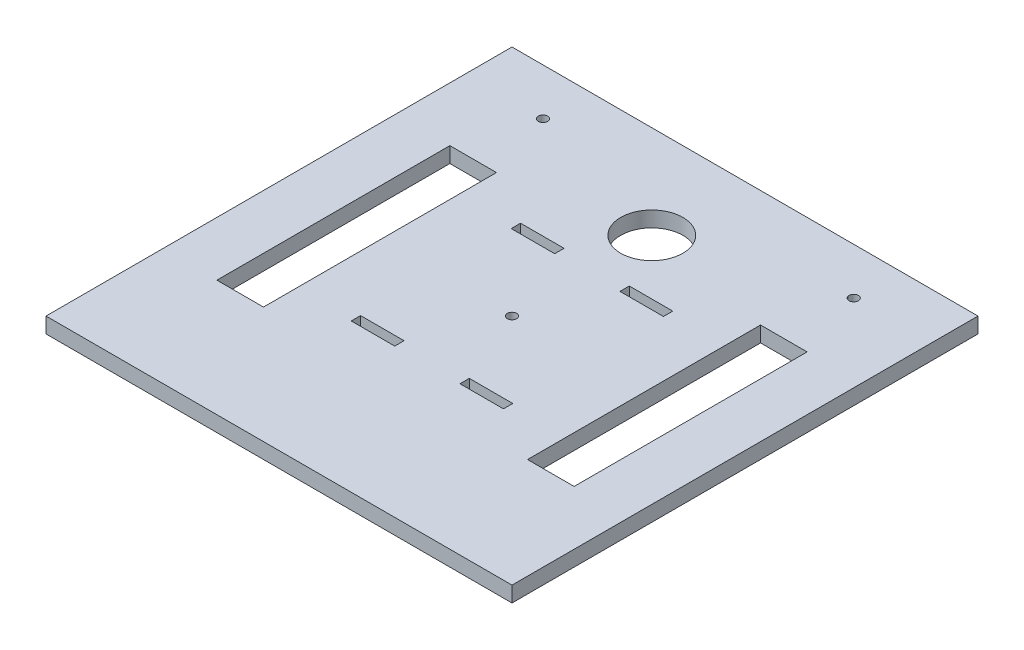
ISO-10303-21;
HEADER;
FILE_DESCRIPTION(('STEP AP214'),'2;1');
FILE_NAME('part.step','',(''),(''),'','','');
FILE_SCHEMA(('AUTOMOTIVE_DESIGN { 1 0 10303 214 1 1 1 1 }'));
ENDSEC;
DATA;
#1=APPLICATION_CONTEXT('core data for automotive mechanical design processes');
#2=APPLICATION_PROTOCOL_DEFINITION('international standard','automotive_design',2000,#1);
#3=PRODUCT_CONTEXT('',#1,'mechanical');
#4=PRODUCT('Part','Part','',(#3));
#5=PRODUCT_RELATED_PRODUCT_CATEGORY('part','',(#4));
#6=PRODUCT_DEFINITION_FORMATION('','',#4);
#7=PRODUCT_DEFINITION_CONTEXT('part definition',#1,'design');
#8=PRODUCT_DEFINITION('design','',#6,#7);
#9=PRODUCT_DEFINITION_SHAPE('','',#8);
#10=(LENGTH_UNIT() NAMED_UNIT(*) SI_UNIT(.MILLI.,.METRE.));
#11=(NAMED_UNIT(*) PLANE_ANGLE_UNIT() SI_UNIT($,.RADIAN.));
#12=(NAMED_UNIT(*) SI_UNIT($,.STERADIAN.) SOLID_ANGLE_UNIT());
#13=UNCERTAINTY_MEASURE_WITH_UNIT(LENGTH_MEASURE(1.E-05),#10,'distance_accuracy_value','');
#14=(GEOMETRIC_REPRESENTATION_CONTEXT(3) GLOBAL_UNCERTAINTY_ASSIGNED_CONTEXT((#13)) GLOBAL_UNIT_ASSIGNED_CONTEXT((#10,
#11,#12)) REPRESENTATION_CONTEXT('',''));
#15=CARTESIAN_POINT('',(0.,0.,0.));
#16=DIRECTION('',(0.,0.,1.));
#17=DIRECTION('',(1.,0.,0.));
#18=AXIS2_PLACEMENT_3D('',#15,#16,#17);
#19=CARTESIAN_POINT('',(0.,5.,0.));
#20=DIRECTION('',(0.,1.,0.));
#21=DIRECTION('',(0.,0.,1.));
#22=AXIS2_PLACEMENT_3D('',#19,#20,#21);
#23=PLANE('',#22);
#24=CARTESIAN_POINT('',(0.,5.,0.));
#25=DIRECTION('',(0.,1.,0.));
#26=DIRECTION('',(0.,0.,1.));
#27=AXIS2_PLACEMENT_3D('',#24,#25,#26);
#28=CIRCLE('',#27,1.5);
#29=CARTESIAN_POINT('',(0.,5.,1.5));
#30=VERTEX_POINT('',#29);
#31=EDGE_CURVE('E249',#30,#30,#28,.T.);
#32=ORIENTED_EDGE('',*,*,#31,.F.);
#33=EDGE_LOOP('',(#32));
#34=FACE_BOUND('',#33,.T.);
#35=CARTESIAN_POINT('',(0.,5.,-45.));
#36=DIRECTION('',(0.,1.,0.));
#37=DIRECTION('',(0.,0.,1.));
#38=AXIS2_PLACEMENT_3D('',#35,#36,#37);
#39=CIRCLE('',#38,10.);
#40=CARTESIAN_POINT('',(0.,5.,-35.));
#41=VERTEX_POINT('',#40);
#42=EDGE_CURVE('E778',#41,#41,#39,.T.);
#43=ORIENTED_EDGE('',*,*,#42,.F.);
#44=EDGE_LOOP('',(#43));
#45=FACE_BOUND('',#44,.T.);
#46=CARTESIAN_POINT('',(50.,5.,-60.));
#47=DIRECTION('',(0.,1.,0.));
#48=DIRECTION('',(0.,0.,1.));
#49=AXIS2_PLACEMENT_3D('',#46,#47,#48);
#50=CIRCLE('',#49,1.5);
#51=CARTESIAN_POINT('',(50.,5.,-58.5));
#52=VERTEX_POINT('',#51);
#53=EDGE_CURVE('E785',#52,#52,#50,.T.);
#54=ORIENTED_EDGE('',*,*,#53,.F.);
#55=EDGE_LOOP('',(#54));
#56=FACE_BOUND('',#55,.T.);
#57=CARTESIAN_POINT('',(-50.,5.,-60.));
#58=DIRECTION('',(0.,1.,0.));
#59=DIRECTION('',(0.,0.,1.));
#60=AXIS2_PLACEMENT_3D('',#57,#58,#59);
#61=CIRCLE('',#60,1.5);
#62=CARTESIAN_POINT('',(-50.,5.,-58.5));
#63=VERTEX_POINT('',#62);
#64=EDGE_CURVE('E791',#63,#63,#61,.T.);
#65=ORIENTED_EDGE('',*,*,#64,.F.);
#66=EDGE_LOOP('',(#65));
#67=FACE_BOUND('',#66,.T.);
#68=DIRECTION('',(0.,0.,-1.));
#69=VECTOR('',#68,1.);
#70=CARTESIAN_POINT('',(24.5,5.,27.25));
#71=LINE('',#70,#69);
#72=CARTESIAN_POINT('',(24.5,5.,27.25));
#73=VERTEX_POINT('',#72);
#74=CARTESIAN_POINT('',(24.5,5.,24.25));
#75=VERTEX_POINT('',#74);
#76=EDGE_CURVE('E48',#73,#75,#71,.T.);
#77=ORIENTED_EDGE('',*,*,#76,.F.);
#78=DIRECTION('',(1.,0.,0.));
#79=VECTOR('',#78,1.);
#80=CARTESIAN_POINT('',(10.5,5.,27.25));
#81=LINE('',#80,#79);
#82=CARTESIAN_POINT('',(10.5,5.,27.25));
#83=VERTEX_POINT('',#82);
#84=EDGE_CURVE('E300',#83,#73,#81,.T.);
#85=ORIENTED_EDGE('',*,*,#84,.F.);
#86=DIRECTION('',(0.,0.,1.));
#87=VECTOR('',#86,1.);
#88=CARTESIAN_POINT('',(10.5,5.,27.25));
#89=LINE('',#88,#87);
#90=CARTESIAN_POINT('',(10.5,5.,24.25));
#91=VERTEX_POINT('',#90);
#92=EDGE_CURVE('E315',#91,#83,#89,.T.);
#93=ORIENTED_EDGE('',*,*,#92,.F.);
#94=DIRECTION('',(-1.,0.,0.));
#95=VECTOR('',#94,1.);
#96=CARTESIAN_POINT('',(10.5,5.,24.25));
#97=LINE('',#96,#95);
#98=EDGE_CURVE('E311',#75,#91,#97,.T.);
#99=ORIENTED_EDGE('',*,*,#98,.F.);
#100=EDGE_LOOP('',(#77,#85,#93,#99));
#101=FACE_BOUND('',#100,.T.);
#102=DIRECTION('',(0.,0.,1.));
#103=VECTOR('',#102,1.);
#104=CARTESIAN_POINT('',(-24.5,5.,27.25));
#105=LINE('',#104,#103);
#106=CARTESIAN_POINT('',(-24.5,5.,24.25));
#107=VERTEX_POINT('',#106);
#108=CARTESIAN_POINT('',(-24.5,5.,27.25));
#109=VERTEX_POINT('',#108);
#110=EDGE_CURVE('E56',#107,#109,#105,.T.);
#111=ORIENTED_EDGE('',*,*,#110,.F.);
#112=DIRECTION('',(-1.,0.,0.));
#113=VECTOR('',#112,1.);
#114=CARTESIAN_POINT('',(-10.5,5.,24.25));
#115=LINE('',#114,#113);
#116=CARTESIAN_POINT('',(-10.5,5.,24.25));
#117=VERTEX_POINT('',#116);
#118=EDGE_CURVE('E270',#117,#107,#115,.T.);
#119=ORIENTED_EDGE('',*,*,#118,.F.);
#120=DIRECTION('',(0.,0.,-1.));
#121=VECTOR('',#120,1.);
#122=CARTESIAN_POINT('',(-10.5,5.,27.25));
#123=LINE('',#122,#121);
#124=CARTESIAN_POINT('',(-10.5,5.,27.25));
#125=VERTEX_POINT('',#124);
#126=EDGE_CURVE('E285',#125,#117,#123,.T.);
#127=ORIENTED_EDGE('',*,*,#126,.F.);
#128=DIRECTION('',(1.,0.,0.));
#129=VECTOR('',#128,1.);
#130=CARTESIAN_POINT('',(-10.5,5.,27.25));
#131=LINE('',#130,#129);
#132=EDGE_CURVE('E281',#109,#125,#131,.T.);
#133=ORIENTED_EDGE('',*,*,#132,.F.);
#134=EDGE_LOOP('',(#111,#119,#127,#133));
#135=FACE_BOUND('',#134,.T.);
#136=DIRECTION('',(0.,0.,1.));
#137=VECTOR('',#136,1.);
#138=CARTESIAN_POINT('',(10.5,5.,-24.25));
#139=LINE('',#138,#137);
#140=CARTESIAN_POINT('',(10.5,5.,-27.25));
#141=VERTEX_POINT('',#140);
#142=CARTESIAN_POINT('',(10.5,5.,-24.25));
#143=VERTEX_POINT('',#142);
#144=EDGE_CURVE('E225',#141,#143,#139,.T.);
#145=ORIENTED_EDGE('',*,*,#144,.F.);
#146=DIRECTION('',(-1.,0.,0.));
#147=VECTOR('',#146,1.);
#148=CARTESIAN_POINT('',(24.5,5.,-27.25));
#149=LINE('',#148,#147);
#150=CARTESIAN_POINT('',(24.5,5.,-27.25));
#151=VERTEX_POINT('',#150);
#152=EDGE_CURVE('E243',#151,#141,#149,.T.);
#153=ORIENTED_EDGE('',*,*,#152,.F.);
#154=DIRECTION('',(0.,0.,-1.));
#155=VECTOR('',#154,1.);
#156=CARTESIAN_POINT('',(24.5,5.,-24.25));
#157=LINE('',#156,#155);
#158=CARTESIAN_POINT('',(24.5,5.,-24.25));
#159=VERTEX_POINT('',#158);
#160=EDGE_CURVE('E246',#159,#151,#157,.T.);
#161=ORIENTED_EDGE('',*,*,#160,.F.);
#162=DIRECTION('',(1.,0.,0.));
#163=VECTOR('',#162,1.);
#164=CARTESIAN_POINT('',(24.5,5.,-24.25));
#165=LINE('',#164,#163);
#166=EDGE_CURVE('E255',#143,#159,#165,.T.);
#167=ORIENTED_EDGE('',*,*,#166,.F.);
#168=EDGE_LOOP('',(#145,#153,#161,#167));
#169=FACE_BOUND('',#168,.T.);
#170=DIRECTION('',(0.,0.,1.));
#171=VECTOR('',#170,1.);
#172=CARTESIAN_POINT('',(-24.5,5.,-24.25));
#173=LINE('',#172,#171);
#174=CARTESIAN_POINT('',(-24.5,5.,-27.25));
#175=VERTEX_POINT('',#174);
#176=CARTESIAN_POINT('',(-24.5,5.,-24.25));
#177=VERTEX_POINT('',#176);
#178=EDGE_CURVE('E262',#175,#177,#173,.T.);
#179=ORIENTED_EDGE('',*,*,#178,.F.);
#180=DIRECTION('',(-1.,0.,0.));
#181=VECTOR('',#180,1.);
#182=CARTESIAN_POINT('',(-10.5,5.,-27.25));
#183=LINE('',#182,#181);
#184=CARTESIAN_POINT('',(-10.5,5.,-27.25));
#185=VERTEX_POINT('',#184);
#186=EDGE_CURVE('E330',#185,#175,#183,.T.);
#187=ORIENTED_EDGE('',*,*,#186,.F.);
#188=DIRECTION('',(0.,0.,-1.));
#189=VECTOR('',#188,1.);
#190=CARTESIAN_POINT('',(-10.5,5.,-24.25));
#191=LINE('',#190,#189);
#192=CARTESIAN_POINT('',(-10.5,5.,-24.25));
#193=VERTEX_POINT('',#192);
#194=EDGE_CURVE('E344',#193,#185,#191,.T.);
#195=ORIENTED_EDGE('',*,*,#194,.F.);
#196=DIRECTION('',(1.,0.,0.));
#197=VECTOR('',#196,1.);
#198=CARTESIAN_POINT('',(-10.5,5.,-24.25));
#199=LINE('',#198,#197);
#200=EDGE_CURVE('E341',#177,#193,#199,.T.);
#201=ORIENTED_EDGE('',*,*,#200,.F.);
#202=EDGE_LOOP('',(#179,#187,#195,#201));
#203=FACE_BOUND('',#202,.T.);
#204=DIRECTION('',(0.,0.,1.));
#205=VECTOR('',#204,1.);
#206=CARTESIAN_POINT('',(-75.,5.,75.));
#207=LINE('',#206,#205);
#208=CARTESIAN_POINT('',(-75.,5.,-75.));
#209=VERTEX_POINT('',#208);
#210=CARTESIAN_POINT('',(-75.,5.,75.));
#211=VERTEX_POINT('',#210);
#212=EDGE_CURVE('E420',#209,#211,#207,.T.);
#213=ORIENTED_EDGE('',*,*,#212,.T.);
#214=DIRECTION('',(1.,0.,0.));
#215=VECTOR('',#214,1.);
#216=CARTESIAN_POINT('',(75.,5.,75.));
#217=LINE('',#216,#215);
#218=CARTESIAN_POINT('',(75.,5.,75.));
#219=VERTEX_POINT('',#218);
#220=EDGE_CURVE('E423',#211,#219,#217,.T.);
#221=ORIENTED_EDGE('',*,*,#220,.T.);
#222=DIRECTION('',(0.,0.,-1.));
#223=VECTOR('',#222,1.);
#224=CARTESIAN_POINT('',(75.,5.,75.));
#225=LINE('',#224,#223);
#226=CARTESIAN_POINT('',(75.,5.,-75.));
#227=VERTEX_POINT('',#226);
#228=EDGE_CURVE('E426',#219,#227,#225,.T.);
#229=ORIENTED_EDGE('',*,*,#228,.T.);
#230=DIRECTION('',(-1.,0.,0.));
#231=VECTOR('',#230,1.);
#232=CARTESIAN_POINT('',(75.,5.,-75.));
#233=LINE('',#232,#231);
#234=EDGE_CURVE('E428',#227,#209,#233,.T.);
#235=ORIENTED_EDGE('',*,*,#234,.T.);
#236=EDGE_LOOP('',(#213,#221,#229,#235));
#237=FACE_BOUND('',#236,.T.);
#238=DIRECTION('',(-1.,0.,0.));
#239=VECTOR('',#238,1.);
#240=CARTESIAN_POINT('',(-57.5,5.,-37.5));
#241=LINE('',#240,#239);
#242=CARTESIAN_POINT('',(-42.5,5.,-37.5));
#243=VERTEX_POINT('',#242);
#244=CARTESIAN_POINT('',(-57.5,5.,-37.5));
#245=VERTEX_POINT('',#244);
#246=EDGE_CURVE('E391',#243,#245,#241,.T.);
#247=ORIENTED_EDGE('',*,*,#246,.F.);
#248=DIRECTION('',(0.,0.,-1.));
#249=VECTOR('',#248,1.);
#250=CARTESIAN_POINT('',(-42.5,5.,37.5));
#251=LINE('',#250,#249);
#252=CARTESIAN_POINT('',(-42.5,5.,37.5));
#253=VERTEX_POINT('',#252);
#254=EDGE_CURVE('E389',#253,#243,#251,.T.);
#255=ORIENTED_EDGE('',*,*,#254,.F.);
#256=DIRECTION('',(1.,0.,0.));
#257=VECTOR('',#256,1.);
#258=CARTESIAN_POINT('',(-57.5,5.,37.5));
#259=LINE('',#258,#257);
#260=CARTESIAN_POINT('',(-57.5,5.,37.5));
#261=VERTEX_POINT('',#260);
#262=EDGE_CURVE('E397',#261,#253,#259,.T.);
#263=ORIENTED_EDGE('',*,*,#262,.F.);
#264=DIRECTION('',(0.,0.,1.));
#265=VECTOR('',#264,1.);
#266=CARTESIAN_POINT('',(-57.5,5.,37.5));
#267=LINE('',#266,#265);
#268=EDGE_CURVE('E394',#245,#261,#267,.T.);
#269=ORIENTED_EDGE('',*,*,#268,.F.);
#270=EDGE_LOOP('',(#247,#255,#263,#269));
#271=FACE_BOUND('',#270,.T.);
#272=DIRECTION('',(1.,0.,0.));
#273=VECTOR('',#272,1.);
#274=CARTESIAN_POINT('',(57.5,5.,37.5));
#275=LINE('',#274,#273);
#276=CARTESIAN_POINT('',(42.5,5.,37.5));
#277=VERTEX_POINT('',#276);
#278=CARTESIAN_POINT('',(57.5,5.,37.5));
#279=VERTEX_POINT('',#278);
#280=EDGE_CURVE('E360',#277,#279,#275,.T.);
#281=ORIENTED_EDGE('',*,*,#280,.F.);
#282=DIRECTION('',(0.,0.,1.));
#283=VECTOR('',#282,1.);
#284=CARTESIAN_POINT('',(42.5,5.,37.5));
#285=LINE('',#284,#283);
#286=CARTESIAN_POINT('',(42.5,5.,-37.5));
#287=VERTEX_POINT('',#286);
#288=EDGE_CURVE('E358',#287,#277,#285,.T.);
#289=ORIENTED_EDGE('',*,*,#288,.F.);
#290=DIRECTION('',(-1.,0.,0.));
#291=VECTOR('',#290,1.);
#292=CARTESIAN_POINT('',(57.5,5.,-37.5));
#293=LINE('',#292,#291);
#294=CARTESIAN_POINT('',(57.5,5.,-37.5));
#295=VERTEX_POINT('',#294);
#296=EDGE_CURVE('E366',#295,#287,#293,.T.);
#297=ORIENTED_EDGE('',*,*,#296,.F.);
#298=DIRECTION('',(0.,0.,-1.));
#299=VECTOR('',#298,1.);
#300=CARTESIAN_POINT('',(57.5,5.,37.5));
#301=LINE('',#300,#299);
#302=EDGE_CURVE('E363',#279,#295,#301,.T.);
#303=ORIENTED_EDGE('',*,*,#302,.F.);
#304=EDGE_LOOP('',(#281,#289,#297,#303));
#305=FACE_BOUND('',#304,.T.);
#306=ADVANCED_FACE('F33',(#34,#45,#56,#67,#101,#135,#169,#203,#237,#271,#305),#23,.T.);
#307=CARTESIAN_POINT('',(0.,0.,0.));
#308=DIRECTION('',(0.,1.,0.));
#309=DIRECTION('',(0.,0.,1.));
#310=AXIS2_PLACEMENT_3D('',#307,#308,#309);
#311=PLANE('',#310);
#312=CARTESIAN_POINT('',(0.,0.,0.));
#313=DIRECTION('',(0.,1.,0.));
#314=DIRECTION('',(0.,0.,1.));
#315=AXIS2_PLACEMENT_3D('',#312,#313,#314);
#316=CIRCLE('',#315,1.5);
#317=CARTESIAN_POINT('',(0.,0.,1.5));
#318=VERTEX_POINT('',#317);
#319=EDGE_CURVE('E776',#318,#318,#316,.T.);
#320=ORIENTED_EDGE('',*,*,#319,.T.);
#321=EDGE_LOOP('',(#320));
#322=FACE_BOUND('',#321,.T.);
#323=CARTESIAN_POINT('',(0.,0.,-45.));
#324=DIRECTION('',(0.,1.,0.));
#325=DIRECTION('',(0.,0.,1.));
#326=AXIS2_PLACEMENT_3D('',#323,#324,#325);
#327=CIRCLE('',#326,10.);
#328=CARTESIAN_POINT('',(0.,0.,-35.));
#329=VERTEX_POINT('',#328);
#330=EDGE_CURVE('E780',#329,#329,#327,.T.);
#331=ORIENTED_EDGE('',*,*,#330,.T.);
#332=EDGE_LOOP('',(#331));
#333=FACE_BOUND('',#332,.T.);
#334=CARTESIAN_POINT('',(50.,0.,-60.));
#335=DIRECTION('',(0.,1.,0.));
#336=DIRECTION('',(0.,0.,1.));
#337=AXIS2_PLACEMENT_3D('',#334,#335,#336);
#338=CIRCLE('',#337,1.5);
#339=CARTESIAN_POINT('',(50.,0.,-58.5));
#340=VERTEX_POINT('',#339);
#341=EDGE_CURVE('E788',#340,#340,#338,.T.);
#342=ORIENTED_EDGE('',*,*,#341,.T.);
#343=EDGE_LOOP('',(#342));
#344=FACE_BOUND('',#343,.T.);
#345=CARTESIAN_POINT('',(-50.,0.,-60.));
#346=DIRECTION('',(0.,1.,0.));
#347=DIRECTION('',(0.,0.,1.));
#348=AXIS2_PLACEMENT_3D('',#345,#346,#347);
#349=CIRCLE('',#348,1.5);
#350=CARTESIAN_POINT('',(-50.,0.,-58.5));
#351=VERTEX_POINT('',#350);
#352=EDGE_CURVE('E312',#351,#351,#349,.T.);
#353=ORIENTED_EDGE('',*,*,#352,.T.);
#354=EDGE_LOOP('',(#353));
#355=FACE_BOUND('',#354,.T.);
#356=DIRECTION('',(1.,0.,0.));
#357=VECTOR('',#356,1.);
#358=CARTESIAN_POINT('',(10.5,0.,27.25));
#359=LINE('',#358,#357);
#360=CARTESIAN_POINT('',(10.5,0.,27.25));
#361=VERTEX_POINT('',#360);
#362=CARTESIAN_POINT('',(24.5,0.,27.25));
#363=VERTEX_POINT('',#362);
#364=EDGE_CURVE('E306',#361,#363,#359,.T.);
#365=ORIENTED_EDGE('',*,*,#364,.T.);
#366=DIRECTION('',(0.,0.,-1.));
#367=VECTOR('',#366,1.);
#368=CARTESIAN_POINT('',(24.5,0.,27.25));
#369=LINE('',#368,#367);
#370=CARTESIAN_POINT('',(24.5,0.,24.25));
#371=VERTEX_POINT('',#370);
#372=EDGE_CURVE('E296',#363,#371,#369,.T.);
#373=ORIENTED_EDGE('',*,*,#372,.T.);
#374=DIRECTION('',(-1.,0.,0.));
#375=VECTOR('',#374,1.);
#376=CARTESIAN_POINT('',(10.5,0.,24.25));
#377=LINE('',#376,#375);
#378=CARTESIAN_POINT('',(10.5,0.,24.25));
#379=VERTEX_POINT('',#378);
#380=EDGE_CURVE('E299',#371,#379,#377,.T.);
#381=ORIENTED_EDGE('',*,*,#380,.T.);
#382=DIRECTION('',(0.,0.,1.));
#383=VECTOR('',#382,1.);
#384=CARTESIAN_POINT('',(10.5,0.,27.25));
#385=LINE('',#384,#383);
#386=EDGE_CURVE('E303',#379,#361,#385,.T.);
#387=ORIENTED_EDGE('',*,*,#386,.T.);
#388=EDGE_LOOP('',(#365,#373,#381,#387));
#389=FACE_BOUND('',#388,.T.);
#390=DIRECTION('',(-1.,0.,0.));
#391=VECTOR('',#390,1.);
#392=CARTESIAN_POINT('',(-10.5,0.,24.25));
#393=LINE('',#392,#391);
#394=CARTESIAN_POINT('',(-10.5,0.,24.25));
#395=VERTEX_POINT('',#394);
#396=CARTESIAN_POINT('',(-24.5,0.,24.25));
#397=VERTEX_POINT('',#396);
#398=EDGE_CURVE('E276',#395,#397,#393,.T.);
#399=ORIENTED_EDGE('',*,*,#398,.T.);
#400=DIRECTION('',(0.,0.,1.));
#401=VECTOR('',#400,1.);
#402=CARTESIAN_POINT('',(-24.5,0.,27.25));
#403=LINE('',#402,#401);
#404=CARTESIAN_POINT('',(-24.5,0.,27.25));
#405=VERTEX_POINT('',#404);
#406=EDGE_CURVE('E266',#397,#405,#403,.T.);
#407=ORIENTED_EDGE('',*,*,#406,.T.);
#408=DIRECTION('',(1.,0.,0.));
#409=VECTOR('',#408,1.);
#410=CARTESIAN_POINT('',(-10.5,0.,27.25));
#411=LINE('',#410,#409);
#412=CARTESIAN_POINT('',(-10.5,0.,27.25));
#413=VERTEX_POINT('',#412);
#414=EDGE_CURVE('E269',#405,#413,#411,.T.);
#415=ORIENTED_EDGE('',*,*,#414,.T.);
#416=DIRECTION('',(0.,0.,-1.));
#417=VECTOR('',#416,1.);
#418=CARTESIAN_POINT('',(-10.5,0.,27.25));
#419=LINE('',#418,#417);
#420=EDGE_CURVE('E273',#413,#395,#419,.T.);
#421=ORIENTED_EDGE('',*,*,#420,.T.);
#422=EDGE_LOOP('',(#399,#407,#415,#421));
#423=FACE_BOUND('',#422,.T.);
#424=DIRECTION('',(-1.,0.,0.));
#425=VECTOR('',#424,1.);
#426=CARTESIAN_POINT('',(24.5,0.,-27.25));
#427=LINE('',#426,#425);
#428=CARTESIAN_POINT('',(24.5,0.,-27.25));
#429=VERTEX_POINT('',#428);
#430=CARTESIAN_POINT('',(10.5,0.,-27.25));
#431=VERTEX_POINT('',#430);
#432=EDGE_CURVE('E230',#429,#431,#427,.T.);
#433=ORIENTED_EDGE('',*,*,#432,.T.);
#434=DIRECTION('',(0.,0.,1.));
#435=VECTOR('',#434,1.);
#436=CARTESIAN_POINT('',(10.5,0.,-24.25));
#437=LINE('',#436,#435);
#438=CARTESIAN_POINT('',(10.5,0.,-24.25));
#439=VERTEX_POINT('',#438);
#440=EDGE_CURVE('E222',#431,#439,#437,.T.);
#441=ORIENTED_EDGE('',*,*,#440,.T.);
#442=DIRECTION('',(1.,0.,0.));
#443=VECTOR('',#442,1.);
#444=CARTESIAN_POINT('',(24.5,0.,-24.25));
#445=LINE('',#444,#443);
#446=CARTESIAN_POINT('',(24.5,0.,-24.25));
#447=VERTEX_POINT('',#446);
#448=EDGE_CURVE('E234',#439,#447,#445,.T.);
#449=ORIENTED_EDGE('',*,*,#448,.T.);
#450=DIRECTION('',(0.,0.,-1.));
#451=VECTOR('',#450,1.);
#452=CARTESIAN_POINT('',(24.5,0.,-24.25));
#453=LINE('',#452,#451);
#454=EDGE_CURVE('E238',#447,#429,#453,.T.);
#455=ORIENTED_EDGE('',*,*,#454,.T.);
#456=EDGE_LOOP('',(#433,#441,#449,#455));
#457=FACE_BOUND('',#456,.T.);
#458=DIRECTION('',(-1.,0.,0.));
#459=VECTOR('',#458,1.);
#460=CARTESIAN_POINT('',(-10.5,0.,-27.25));
#461=LINE('',#460,#459);
#462=CARTESIAN_POINT('',(-10.5,0.,-27.25));
#463=VERTEX_POINT('',#462);
#464=CARTESIAN_POINT('',(-24.5,0.,-27.25));
#465=VERTEX_POINT('',#464);
#466=EDGE_CURVE('E336',#463,#465,#461,.T.);
#467=ORIENTED_EDGE('',*,*,#466,.T.);
#468=DIRECTION('',(0.,0.,1.));
#469=VECTOR('',#468,1.);
#470=CARTESIAN_POINT('',(-24.5,0.,-24.25));
#471=LINE('',#470,#469);
#472=CARTESIAN_POINT('',(-24.5,0.,-24.25));
#473=VERTEX_POINT('',#472);
#474=EDGE_CURVE('E326',#465,#473,#471,.T.);
#475=ORIENTED_EDGE('',*,*,#474,.T.);
#476=DIRECTION('',(1.,0.,0.));
#477=VECTOR('',#476,1.);
#478=CARTESIAN_POINT('',(-10.5,0.,-24.25));
#479=LINE('',#478,#477);
#480=CARTESIAN_POINT('',(-10.5,0.,-24.25));
#481=VERTEX_POINT('',#480);
#482=EDGE_CURVE('E329',#473,#481,#479,.T.);
#483=ORIENTED_EDGE('',*,*,#482,.T.);
#484=DIRECTION('',(0.,0.,-1.));
#485=VECTOR('',#484,1.);
#486=CARTESIAN_POINT('',(-10.5,0.,-24.25));
#487=LINE('',#486,#485);
#488=EDGE_CURVE('E333',#481,#463,#487,.T.);
#489=ORIENTED_EDGE('',*,*,#488,.T.);
#490=EDGE_LOOP('',(#467,#475,#483,#489));
#491=FACE_BOUND('',#490,.T.);
#492=DIRECTION('',(0.,0.,-1.));
#493=VECTOR('',#492,1.);
#494=CARTESIAN_POINT('',(-42.5,0.,37.5));
#495=LINE('',#494,#493);
#496=CARTESIAN_POINT('',(-42.5,0.,37.5));
#497=VERTEX_POINT('',#496);
#498=CARTESIAN_POINT('',(-42.5,0.,-37.5));
#499=VERTEX_POINT('',#498);
#500=EDGE_CURVE('E388',#497,#499,#495,.T.);
#501=ORIENTED_EDGE('',*,*,#500,.T.);
#502=DIRECTION('',(-1.,0.,0.));
#503=VECTOR('',#502,1.);
#504=CARTESIAN_POINT('',(-57.5,0.,-37.5));
#505=LINE('',#504,#503);
#506=CARTESIAN_POINT('',(-57.5,0.,-37.5));
#507=VERTEX_POINT('',#506);
#508=EDGE_CURVE('E402',#499,#507,#505,.T.);
#509=ORIENTED_EDGE('',*,*,#508,.T.);
#510=DIRECTION('',(0.,0.,1.));
#511=VECTOR('',#510,1.);
#512=CARTESIAN_POINT('',(-57.5,0.,37.5));
#513=LINE('',#512,#511);
#514=CARTESIAN_POINT('',(-57.5,0.,37.5));
#515=VERTEX_POINT('',#514);
#516=EDGE_CURVE('E405',#507,#515,#513,.T.);
#517=ORIENTED_EDGE('',*,*,#516,.T.);
#518=DIRECTION('',(1.,0.,0.));
#519=VECTOR('',#518,1.);
#520=CARTESIAN_POINT('',(-57.5,0.,37.5));
#521=LINE('',#520,#519);
#522=EDGE_CURVE('E392',#515,#497,#521,.T.);
#523=ORIENTED_EDGE('',*,*,#522,.T.);
#524=EDGE_LOOP('',(#501,#509,#517,#523));
#525=FACE_BOUND('',#524,.T.);
#526=DIRECTION('',(0.,0.,1.));
#527=VECTOR('',#526,1.);
#528=CARTESIAN_POINT('',(-75.,0.,75.));
#529=LINE('',#528,#527);
#530=CARTESIAN_POINT('',(-75.,0.,-75.));
#531=VERTEX_POINT('',#530);
#532=CARTESIAN_POINT('',(-75.,0.,75.));
#533=VERTEX_POINT('',#532);
#534=EDGE_CURVE('E419',#531,#533,#529,.T.);
#535=ORIENTED_EDGE('',*,*,#534,.F.);
#536=DIRECTION('',(-1.,0.,0.));
#537=VECTOR('',#536,1.);
#538=CARTESIAN_POINT('',(75.,0.,-75.));
#539=LINE('',#538,#537);
#540=CARTESIAN_POINT('',(75.,0.,-75.));
#541=VERTEX_POINT('',#540);
#542=EDGE_CURVE('E424',#541,#531,#539,.T.);
#543=ORIENTED_EDGE('',*,*,#542,.F.);
#544=DIRECTION('',(0.,0.,-1.));
#545=VECTOR('',#544,1.);
#546=CARTESIAN_POINT('',(75.,0.,75.));
#547=LINE('',#546,#545);
#548=CARTESIAN_POINT('',(75.,0.,75.));
#549=VERTEX_POINT('',#548);
#550=EDGE_CURVE('E435',#549,#541,#547,.T.);
#551=ORIENTED_EDGE('',*,*,#550,.F.);
#552=DIRECTION('',(1.,0.,0.));
#553=VECTOR('',#552,1.);
#554=CARTESIAN_POINT('',(75.,0.,75.));
#555=LINE('',#554,#553);
#556=EDGE_CURVE('E433',#533,#549,#555,.T.);
#557=ORIENTED_EDGE('',*,*,#556,.F.);
#558=EDGE_LOOP('',(#535,#543,#551,#557));
#559=FACE_BOUND('',#558,.T.);
#560=DIRECTION('',(0.,0.,1.));
#561=VECTOR('',#560,1.);
#562=CARTESIAN_POINT('',(42.5,0.,37.5));
#563=LINE('',#562,#561);
#564=CARTESIAN_POINT('',(42.5,0.,-37.5));
#565=VERTEX_POINT('',#564);
#566=CARTESIAN_POINT('',(42.5,0.,37.5));
#567=VERTEX_POINT('',#566);
#568=EDGE_CURVE('E351',#565,#567,#563,.T.);
#569=ORIENTED_EDGE('',*,*,#568,.T.);
#570=DIRECTION('',(1.,0.,0.));
#571=VECTOR('',#570,1.);
#572=CARTESIAN_POINT('',(57.5,0.,37.5));
#573=LINE('',#572,#571);
#574=CARTESIAN_POINT('',(57.5,0.,37.5));
#575=VERTEX_POINT('',#574);
#576=EDGE_CURVE('E371',#567,#575,#573,.T.);
#577=ORIENTED_EDGE('',*,*,#576,.T.);
#578=DIRECTION('',(0.,0.,-1.));
#579=VECTOR('',#578,1.);
#580=CARTESIAN_POINT('',(57.5,0.,37.5));
#581=LINE('',#580,#579);
#582=CARTESIAN_POINT('',(57.5,0.,-37.5));
#583=VERTEX_POINT('',#582);
#584=EDGE_CURVE('E374',#575,#583,#581,.T.);
#585=ORIENTED_EDGE('',*,*,#584,.T.);
#586=DIRECTION('',(-1.,0.,0.));
#587=VECTOR('',#586,1.);
#588=CARTESIAN_POINT('',(57.5,0.,-37.5));
#589=LINE('',#588,#587);
#590=EDGE_CURVE('E361',#583,#565,#589,.T.);
#591=ORIENTED_EDGE('',*,*,#590,.T.);
#592=EDGE_LOOP('',(#569,#577,#585,#591));
#593=FACE_BOUND('',#592,.T.);
#594=ADVANCED_FACE('F240',(#322,#333,#344,#355,#389,#423,#457,#491,#525,#559,#593),#311,.F.);
#595=CARTESIAN_POINT('',(-75.,5.,75.));
#596=DIRECTION('',(1.,0.,0.));
#597=DIRECTION('',(0.,0.,-1.));
#598=AXIS2_PLACEMENT_3D('',#595,#596,#597);
#599=PLANE('',#598);
#600=ORIENTED_EDGE('',*,*,#534,.T.);
#601=DIRECTION('',(0.,-1.,0.));
#602=VECTOR('',#601,1.);
#603=CARTESIAN_POINT('',(-75.,5.,75.));
#604=LINE('',#603,#602);
#605=EDGE_CURVE('E11',#211,#533,#604,.T.);
#606=ORIENTED_EDGE('',*,*,#605,.F.);
#607=ORIENTED_EDGE('',*,*,#212,.F.);
#608=DIRECTION('',(0.,-1.,0.));
#609=VECTOR('',#608,1.);
#610=CARTESIAN_POINT('',(-75.,5.,-75.));
#611=LINE('',#610,#609);
#612=EDGE_CURVE('E430',#209,#531,#611,.T.);
#613=ORIENTED_EDGE('',*,*,#612,.T.);
#614=EDGE_LOOP('',(#600,#606,#607,#613));
#615=FACE_BOUND('',#614,.T.);
#616=ADVANCED_FACE('F35',(#615),#599,.F.);
#617=CARTESIAN_POINT('',(75.,5.,75.));
#618=DIRECTION('',(0.,0.,-1.));
#619=DIRECTION('',(-1.,0.,0.));
#620=AXIS2_PLACEMENT_3D('',#617,#618,#619);
#621=PLANE('',#620);
#622=ORIENTED_EDGE('',*,*,#556,.T.);
#623=DIRECTION('',(0.,-1.,0.));
#624=VECTOR('',#623,1.);
#625=CARTESIAN_POINT('',(75.,5.,75.));
#626=LINE('',#625,#624);
#627=EDGE_CURVE('E41',#219,#549,#626,.T.);
#628=ORIENTED_EDGE('',*,*,#627,.F.);
#629=ORIENTED_EDGE('',*,*,#220,.F.);
#630=ORIENTED_EDGE('',*,*,#605,.T.);
#631=EDGE_LOOP('',(#622,#628,#629,#630));
#632=FACE_BOUND('',#631,.T.);
#633=ADVANCED_FACE('F463',(#632),#621,.F.);
#634=CARTESIAN_POINT('',(75.,5.,75.));
#635=DIRECTION('',(-1.,0.,0.));
#636=DIRECTION('',(0.,0.,1.));
#637=AXIS2_PLACEMENT_3D('',#634,#635,#636);
#638=PLANE('',#637);
#639=ORIENTED_EDGE('',*,*,#550,.T.);
#640=DIRECTION('',(0.,-1.,0.));
#641=VECTOR('',#640,1.);
#642=CARTESIAN_POINT('',(75.,5.,-75.));
#643=LINE('',#642,#641);
#644=EDGE_CURVE('E440',#227,#541,#643,.T.);
#645=ORIENTED_EDGE('',*,*,#644,.F.);
#646=ORIENTED_EDGE('',*,*,#228,.F.);
#647=ORIENTED_EDGE('',*,*,#627,.T.);
#648=EDGE_LOOP('',(#639,#645,#646,#647));
#649=FACE_BOUND('',#648,.T.);
#650=ADVANCED_FACE('F447',(#649),#638,.F.);
#651=CARTESIAN_POINT('',(75.,5.,-75.));
#652=DIRECTION('',(0.,0.,1.));
#653=DIRECTION('',(1.,0.,0.));
#654=AXIS2_PLACEMENT_3D('',#651,#652,#653);
#655=PLANE('',#654);
#656=ORIENTED_EDGE('',*,*,#542,.T.);
#657=ORIENTED_EDGE('',*,*,#612,.F.);
#658=ORIENTED_EDGE('',*,*,#234,.F.);
#659=ORIENTED_EDGE('',*,*,#644,.T.);
#660=EDGE_LOOP('',(#656,#657,#658,#659));
#661=FACE_BOUND('',#660,.T.);
#662=ADVANCED_FACE('F456',(#661),#655,.F.);
#663=CARTESIAN_POINT('',(-42.5,5.,37.5));
#664=DIRECTION('',(-1.,0.,0.));
#665=DIRECTION('',(0.,0.,1.));
#666=AXIS2_PLACEMENT_3D('',#663,#664,#665);
#667=PLANE('',#666);
#668=ORIENTED_EDGE('',*,*,#500,.F.);
#669=DIRECTION('',(0.,-1.,0.));
#670=VECTOR('',#669,1.);
#671=CARTESIAN_POINT('',(-42.5,5.,37.5));
#672=LINE('',#671,#670);
#673=EDGE_CURVE('E399',#253,#497,#672,.T.);
#674=ORIENTED_EDGE('',*,*,#673,.F.);
#675=ORIENTED_EDGE('',*,*,#254,.T.);
#676=DIRECTION('',(0.,-1.,0.));
#677=VECTOR('',#676,1.);
#678=CARTESIAN_POINT('',(-42.5,5.,-37.5));
#679=LINE('',#678,#677);
#680=EDGE_CURVE('E416',#243,#499,#679,.T.);
#681=ORIENTED_EDGE('',*,*,#680,.T.);
#682=EDGE_LOOP('',(#668,#674,#675,#681));
#683=FACE_BOUND('',#682,.T.);
#684=ADVANCED_FACE('F481',(#683),#667,.T.);
#685=CARTESIAN_POINT('',(-57.5,5.,-37.5));
#686=DIRECTION('',(0.,0.,1.));
#687=DIRECTION('',(1.,0.,0.));
#688=AXIS2_PLACEMENT_3D('',#685,#686,#687);
#689=PLANE('',#688);
#690=ORIENTED_EDGE('',*,*,#508,.F.);
#691=ORIENTED_EDGE('',*,*,#680,.F.);
#692=ORIENTED_EDGE('',*,*,#246,.T.);
#693=DIRECTION('',(0.,-1.,0.));
#694=VECTOR('',#693,1.);
#695=CARTESIAN_POINT('',(-57.5,5.,-37.5));
#696=LINE('',#695,#694);
#697=EDGE_CURVE('E414',#245,#507,#696,.T.);
#698=ORIENTED_EDGE('',*,*,#697,.T.);
#699=EDGE_LOOP('',(#690,#691,#692,#698));
#700=FACE_BOUND('',#699,.T.);
#701=ADVANCED_FACE('F488',(#700),#689,.T.);
#702=CARTESIAN_POINT('',(-57.5,5.,37.5));
#703=DIRECTION('',(1.,0.,0.));
#704=DIRECTION('',(0.,0.,-1.));
#705=AXIS2_PLACEMENT_3D('',#702,#703,#704);
#706=PLANE('',#705);
#707=ORIENTED_EDGE('',*,*,#516,.F.);
#708=ORIENTED_EDGE('',*,*,#697,.F.);
#709=ORIENTED_EDGE('',*,*,#268,.T.);
#710=DIRECTION('',(0.,-1.,0.));
#711=VECTOR('',#710,1.);
#712=CARTESIAN_POINT('',(-57.5,5.,37.5));
#713=LINE('',#712,#711);
#714=EDGE_CURVE('E412',#261,#515,#713,.T.);
#715=ORIENTED_EDGE('',*,*,#714,.T.);
#716=EDGE_LOOP('',(#707,#708,#709,#715));
#717=FACE_BOUND('',#716,.T.);
#718=ADVANCED_FACE('F493',(#717),#706,.T.);
#719=CARTESIAN_POINT('',(-57.5,5.,37.5));
#720=DIRECTION('',(0.,0.,-1.));
#721=DIRECTION('',(-1.,0.,0.));
#722=AXIS2_PLACEMENT_3D('',#719,#720,#721);
#723=PLANE('',#722);
#724=ORIENTED_EDGE('',*,*,#522,.F.);
#725=ORIENTED_EDGE('',*,*,#714,.F.);
#726=ORIENTED_EDGE('',*,*,#262,.T.);
#727=ORIENTED_EDGE('',*,*,#673,.T.);
#728=EDGE_LOOP('',(#724,#725,#726,#727));
#729=FACE_BOUND('',#728,.T.);
#730=ADVANCED_FACE('F501',(#729),#723,.T.);
#731=CARTESIAN_POINT('',(42.5,5.,37.5));
#732=DIRECTION('',(1.,0.,0.));
#733=DIRECTION('',(0.,0.,-1.));
#734=AXIS2_PLACEMENT_3D('',#731,#732,#733);
#735=PLANE('',#734);
#736=ORIENTED_EDGE('',*,*,#568,.F.);
#737=DIRECTION('',(0.,-1.,0.));
#738=VECTOR('',#737,1.);
#739=CARTESIAN_POINT('',(42.5,5.,-37.5));
#740=LINE('',#739,#738);
#741=EDGE_CURVE('E368',#287,#565,#740,.T.);
#742=ORIENTED_EDGE('',*,*,#741,.F.);
#743=ORIENTED_EDGE('',*,*,#288,.T.);
#744=DIRECTION('',(0.,-1.,0.));
#745=VECTOR('',#744,1.);
#746=CARTESIAN_POINT('',(42.5,5.,37.5));
#747=LINE('',#746,#745);
#748=EDGE_CURVE('E385',#277,#567,#747,.T.);
#749=ORIENTED_EDGE('',*,*,#748,.T.);
#750=EDGE_LOOP('',(#736,#742,#743,#749));
#751=FACE_BOUND('',#750,.T.);
#752=ADVANCED_FACE('F522',(#751),#735,.T.);
#753=CARTESIAN_POINT('',(57.5,5.,37.5));
#754=DIRECTION('',(0.,0.,-1.));
#755=DIRECTION('',(-1.,0.,0.));
#756=AXIS2_PLACEMENT_3D('',#753,#754,#755);
#757=PLANE('',#756);
#758=ORIENTED_EDGE('',*,*,#576,.F.);
#759=ORIENTED_EDGE('',*,*,#748,.F.);
#760=ORIENTED_EDGE('',*,*,#280,.T.);
#761=DIRECTION('',(0.,-1.,0.));
#762=VECTOR('',#761,1.);
#763=CARTESIAN_POINT('',(57.5,5.,37.5));
#764=LINE('',#763,#762);
#765=EDGE_CURVE('E383',#279,#575,#764,.T.);
#766=ORIENTED_EDGE('',*,*,#765,.T.);
#767=EDGE_LOOP('',(#758,#759,#760,#766));
#768=FACE_BOUND('',#767,.T.);
#769=ADVANCED_FACE('F516',(#768),#757,.T.);
#770=CARTESIAN_POINT('',(57.5,5.,37.5));
#771=DIRECTION('',(-1.,0.,0.));
#772=DIRECTION('',(0.,0.,1.));
#773=AXIS2_PLACEMENT_3D('',#770,#771,#772);
#774=PLANE('',#773);
#775=ORIENTED_EDGE('',*,*,#584,.F.);
#776=ORIENTED_EDGE('',*,*,#765,.F.);
#777=ORIENTED_EDGE('',*,*,#302,.T.);
#778=DIRECTION('',(0.,-1.,0.));
#779=VECTOR('',#778,1.);
#780=CARTESIAN_POINT('',(57.5,5.,-37.5));
#781=LINE('',#780,#779);
#782=EDGE_CURVE('E381',#295,#583,#781,.T.);
#783=ORIENTED_EDGE('',*,*,#782,.T.);
#784=EDGE_LOOP('',(#775,#776,#777,#783));
#785=FACE_BOUND('',#784,.T.);
#786=ADVANCED_FACE('F519',(#785),#774,.T.);
#787=CARTESIAN_POINT('',(57.5,5.,-37.5));
#788=DIRECTION('',(0.,0.,1.));
#789=DIRECTION('',(1.,0.,0.));
#790=AXIS2_PLACEMENT_3D('',#787,#788,#789);
#791=PLANE('',#790);
#792=ORIENTED_EDGE('',*,*,#590,.F.);
#793=ORIENTED_EDGE('',*,*,#782,.F.);
#794=ORIENTED_EDGE('',*,*,#296,.T.);
#795=ORIENTED_EDGE('',*,*,#741,.T.);
#796=EDGE_LOOP('',(#792,#793,#794,#795));
#797=FACE_BOUND('',#796,.T.);
#798=ADVANCED_FACE('F525',(#797),#791,.T.);
#799=CARTESIAN_POINT('',(-24.5,0.,-24.25));
#800=DIRECTION('',(-1.,0.,0.));
#801=DIRECTION('',(0.,0.,1.));
#802=AXIS2_PLACEMENT_3D('',#799,#800,#801);
#803=PLANE('',#802);
#804=ORIENTED_EDGE('',*,*,#178,.T.);
#805=DIRECTION('',(0.,1.,0.));
#806=VECTOR('',#805,1.);
#807=CARTESIAN_POINT('',(-24.5,0.,-24.25));
#808=LINE('',#807,#806);
#809=EDGE_CURVE('E339',#473,#177,#808,.T.);
#810=ORIENTED_EDGE('',*,*,#809,.F.);
#811=ORIENTED_EDGE('',*,*,#474,.F.);
#812=DIRECTION('',(0.,1.,0.));
#813=VECTOR('',#812,1.);
#814=CARTESIAN_POINT('',(-24.5,0.,-27.25));
#815=LINE('',#814,#813);
#816=EDGE_CURVE('E349',#465,#175,#815,.T.);
#817=ORIENTED_EDGE('',*,*,#816,.T.);
#818=EDGE_LOOP('',(#804,#810,#811,#817));
#819=FACE_BOUND('',#818,.T.);
#820=ADVANCED_FACE('F527',(#819),#803,.F.);
#821=CARTESIAN_POINT('',(-10.5,0.,-27.25));
#822=DIRECTION('',(0.,0.,-1.));
#823=DIRECTION('',(-1.,0.,0.));
#824=AXIS2_PLACEMENT_3D('',#821,#822,#823);
#825=PLANE('',#824);
#826=ORIENTED_EDGE('',*,*,#186,.T.);
#827=ORIENTED_EDGE('',*,*,#816,.F.);
#828=ORIENTED_EDGE('',*,*,#466,.F.);
#829=DIRECTION('',(0.,1.,0.));
#830=VECTOR('',#829,1.);
#831=CARTESIAN_POINT('',(-10.5,0.,-27.25));
#832=LINE('',#831,#830);
#833=EDGE_CURVE('E352',#463,#185,#832,.T.);
#834=ORIENTED_EDGE('',*,*,#833,.T.);
#835=EDGE_LOOP('',(#826,#827,#828,#834));
#836=FACE_BOUND('',#835,.T.);
#837=ADVANCED_FACE('F533',(#836),#825,.F.);
#838=CARTESIAN_POINT('',(-10.5,0.,-24.25));
#839=DIRECTION('',(1.,0.,0.));
#840=DIRECTION('',(0.,0.,-1.));
#841=AXIS2_PLACEMENT_3D('',#838,#839,#840);
#842=PLANE('',#841);
#843=ORIENTED_EDGE('',*,*,#194,.T.);
#844=ORIENTED_EDGE('',*,*,#833,.F.);
#845=ORIENTED_EDGE('',*,*,#488,.F.);
#846=DIRECTION('',(0.,1.,0.));
#847=VECTOR('',#846,1.);
#848=CARTESIAN_POINT('',(-10.5,0.,-24.25));
#849=LINE('',#848,#847);
#850=EDGE_CURVE('E354',#481,#193,#849,.T.);
#851=ORIENTED_EDGE('',*,*,#850,.T.);
#852=EDGE_LOOP('',(#843,#844,#845,#851));
#853=FACE_BOUND('',#852,.T.);
#854=ADVANCED_FACE('F596',(#853),#842,.F.);
#855=CARTESIAN_POINT('',(-10.5,0.,-24.25));
#856=DIRECTION('',(0.,0.,1.));
#857=DIRECTION('',(1.,0.,0.));
#858=AXIS2_PLACEMENT_3D('',#855,#856,#857);
#859=PLANE('',#858);
#860=ORIENTED_EDGE('',*,*,#200,.T.);
#861=ORIENTED_EDGE('',*,*,#850,.F.);
#862=ORIENTED_EDGE('',*,*,#482,.F.);
#863=ORIENTED_EDGE('',*,*,#809,.T.);
#864=EDGE_LOOP('',(#860,#861,#862,#863));
#865=FACE_BOUND('',#864,.T.);
#866=ADVANCED_FACE('F606',(#865),#859,.F.);
#867=CARTESIAN_POINT('',(10.5,0.,-24.25));
#868=DIRECTION('',(-1.,0.,0.));
#869=DIRECTION('',(0.,0.,1.));
#870=AXIS2_PLACEMENT_3D('',#867,#868,#869);
#871=PLANE('',#870);
#872=ORIENTED_EDGE('',*,*,#144,.T.);
#873=DIRECTION('',(0.,1.,0.));
#874=VECTOR('',#873,1.);
#875=CARTESIAN_POINT('',(10.5,0.,-24.25));
#876=LINE('',#875,#874);
#877=EDGE_CURVE('E218',#439,#143,#876,.T.);
#878=ORIENTED_EDGE('',*,*,#877,.F.);
#879=ORIENTED_EDGE('',*,*,#440,.F.);
#880=DIRECTION('',(0.,1.,0.));
#881=VECTOR('',#880,1.);
#882=CARTESIAN_POINT('',(10.5,0.,-27.25));
#883=LINE('',#882,#881);
#884=EDGE_CURVE('E260',#431,#141,#883,.T.);
#885=ORIENTED_EDGE('',*,*,#884,.T.);
#886=EDGE_LOOP('',(#872,#878,#879,#885));
#887=FACE_BOUND('',#886,.T.);
#888=ADVANCED_FACE('F220',(#887),#871,.F.);
#889=CARTESIAN_POINT('',(24.5,0.,-27.25));
#890=DIRECTION('',(0.,0.,-1.));
#891=DIRECTION('',(-1.,0.,0.));
#892=AXIS2_PLACEMENT_3D('',#889,#890,#891);
#893=PLANE('',#892);
#894=ORIENTED_EDGE('',*,*,#152,.T.);
#895=ORIENTED_EDGE('',*,*,#884,.F.);
#896=ORIENTED_EDGE('',*,*,#432,.F.);
#897=DIRECTION('',(0.,1.,0.));
#898=VECTOR('',#897,1.);
#899=CARTESIAN_POINT('',(24.5,0.,-27.25));
#900=LINE('',#899,#898);
#901=EDGE_CURVE('E263',#429,#151,#900,.T.);
#902=ORIENTED_EDGE('',*,*,#901,.T.);
#903=EDGE_LOOP('',(#894,#895,#896,#902));
#904=FACE_BOUND('',#903,.T.);
#905=ADVANCED_FACE('F624',(#904),#893,.F.);
#906=CARTESIAN_POINT('',(24.5,0.,-24.25));
#907=DIRECTION('',(1.,0.,0.));
#908=DIRECTION('',(0.,0.,-1.));
#909=AXIS2_PLACEMENT_3D('',#906,#907,#908);
#910=PLANE('',#909);
#911=ORIENTED_EDGE('',*,*,#160,.T.);
#912=ORIENTED_EDGE('',*,*,#901,.F.);
#913=ORIENTED_EDGE('',*,*,#454,.F.);
#914=DIRECTION('',(0.,1.,0.));
#915=VECTOR('',#914,1.);
#916=CARTESIAN_POINT('',(24.5,0.,-24.25));
#917=LINE('',#916,#915);
#918=EDGE_CURVE('E229',#447,#159,#917,.T.);
#919=ORIENTED_EDGE('',*,*,#918,.T.);
#920=EDGE_LOOP('',(#911,#912,#913,#919));
#921=FACE_BOUND('',#920,.T.);
#922=ADVANCED_FACE('F633',(#921),#910,.F.);
#923=CARTESIAN_POINT('',(24.5,0.,-24.25));
#924=DIRECTION('',(0.,0.,1.));
#925=DIRECTION('',(1.,0.,0.));
#926=AXIS2_PLACEMENT_3D('',#923,#924,#925);
#927=PLANE('',#926);
#928=ORIENTED_EDGE('',*,*,#166,.T.);
#929=ORIENTED_EDGE('',*,*,#918,.F.);
#930=ORIENTED_EDGE('',*,*,#448,.F.);
#931=ORIENTED_EDGE('',*,*,#877,.T.);
#932=EDGE_LOOP('',(#928,#929,#930,#931));
#933=FACE_BOUND('',#932,.T.);
#934=ADVANCED_FACE('F235',(#933),#927,.F.);
#935=CARTESIAN_POINT('',(-24.5,0.,27.25));
#936=DIRECTION('',(-1.,0.,0.));
#937=DIRECTION('',(0.,0.,1.));
#938=AXIS2_PLACEMENT_3D('',#935,#936,#937);
#939=PLANE('',#938);
#940=ORIENTED_EDGE('',*,*,#110,.T.);
#941=DIRECTION('',(0.,1.,0.));
#942=VECTOR('',#941,1.);
#943=CARTESIAN_POINT('',(-24.5,0.,27.25));
#944=LINE('',#943,#942);
#945=EDGE_CURVE('E279',#405,#109,#944,.T.);
#946=ORIENTED_EDGE('',*,*,#945,.F.);
#947=ORIENTED_EDGE('',*,*,#406,.F.);
#948=DIRECTION('',(0.,1.,0.));
#949=VECTOR('',#948,1.);
#950=CARTESIAN_POINT('',(-24.5,0.,24.25));
#951=LINE('',#950,#949);
#952=EDGE_CURVE('E256',#397,#107,#951,.T.);
#953=ORIENTED_EDGE('',*,*,#952,.T.);
#954=EDGE_LOOP('',(#940,#946,#947,#953));
#955=FACE_BOUND('',#954,.T.);
#956=ADVANCED_FACE('F652',(#955),#939,.F.);
#957=CARTESIAN_POINT('',(-10.5,0.,24.25));
#958=DIRECTION('',(0.,0.,-1.));
#959=DIRECTION('',(-1.,0.,0.));
#960=AXIS2_PLACEMENT_3D('',#957,#958,#959);
#961=PLANE('',#960);
#962=ORIENTED_EDGE('',*,*,#118,.T.);
#963=ORIENTED_EDGE('',*,*,#952,.F.);
#964=ORIENTED_EDGE('',*,*,#398,.F.);
#965=DIRECTION('',(0.,1.,0.));
#966=VECTOR('',#965,1.);
#967=CARTESIAN_POINT('',(-10.5,0.,24.25));
#968=LINE('',#967,#966);
#969=EDGE_CURVE('E291',#395,#117,#968,.T.);
#970=ORIENTED_EDGE('',*,*,#969,.T.);
#971=EDGE_LOOP('',(#962,#963,#964,#970));
#972=FACE_BOUND('',#971,.T.);
#973=ADVANCED_FACE('F661',(#972),#961,.F.);
#974=CARTESIAN_POINT('',(-10.5,0.,27.25));
#975=DIRECTION('',(1.,0.,0.));
#976=DIRECTION('',(0.,0.,-1.));
#977=AXIS2_PLACEMENT_3D('',#974,#975,#976);
#978=PLANE('',#977);
#979=ORIENTED_EDGE('',*,*,#126,.T.);
#980=ORIENTED_EDGE('',*,*,#969,.F.);
#981=ORIENTED_EDGE('',*,*,#420,.F.);
#982=DIRECTION('',(0.,1.,0.));
#983=VECTOR('',#982,1.);
#984=CARTESIAN_POINT('',(-10.5,0.,27.25));
#985=LINE('',#984,#983);
#986=EDGE_CURVE('E293',#413,#125,#985,.T.);
#987=ORIENTED_EDGE('',*,*,#986,.T.);
#988=EDGE_LOOP('',(#979,#980,#981,#987));
#989=FACE_BOUND('',#988,.T.);
#990=ADVANCED_FACE('F670',(#989),#978,.F.);
#991=CARTESIAN_POINT('',(-10.5,0.,27.25));
#992=DIRECTION('',(0.,0.,1.));
#993=DIRECTION('',(1.,0.,0.));
#994=AXIS2_PLACEMENT_3D('',#991,#992,#993);
#995=PLANE('',#994);
#996=ORIENTED_EDGE('',*,*,#132,.T.);
#997=ORIENTED_EDGE('',*,*,#986,.F.);
#998=ORIENTED_EDGE('',*,*,#414,.F.);
#999=ORIENTED_EDGE('',*,*,#945,.T.);
#1000=EDGE_LOOP('',(#996,#997,#998,#999));
#1001=FACE_BOUND('',#1000,.T.);
#1002=ADVANCED_FACE('F680',(#1001),#995,.F.);
#1003=CARTESIAN_POINT('',(24.5,0.,27.25));
#1004=DIRECTION('',(1.,0.,0.));
#1005=DIRECTION('',(0.,0.,-1.));
#1006=AXIS2_PLACEMENT_3D('',#1003,#1004,#1005);
#1007=PLANE('',#1006);
#1008=ORIENTED_EDGE('',*,*,#76,.T.);
#1009=DIRECTION('',(0.,1.,0.));
#1010=VECTOR('',#1009,1.);
#1011=CARTESIAN_POINT('',(24.5,0.,24.25));
#1012=LINE('',#1011,#1010);
#1013=EDGE_CURVE('E309',#371,#75,#1012,.T.);
#1014=ORIENTED_EDGE('',*,*,#1013,.F.);
#1015=ORIENTED_EDGE('',*,*,#372,.F.);
#1016=DIRECTION('',(0.,1.,0.));
#1017=VECTOR('',#1016,1.);
#1018=CARTESIAN_POINT('',(24.5,0.,27.25));
#1019=LINE('',#1018,#1017);
#1020=EDGE_CURVE('E282',#363,#73,#1019,.T.);
#1021=ORIENTED_EDGE('',*,*,#1020,.T.);
#1022=EDGE_LOOP('',(#1008,#1014,#1015,#1021));
#1023=FACE_BOUND('',#1022,.T.);
#1024=ADVANCED_FACE('F690',(#1023),#1007,.F.);
#1025=CARTESIAN_POINT('',(10.5,0.,27.25));
#1026=DIRECTION('',(0.,0.,1.));
#1027=DIRECTION('',(1.,0.,0.));
#1028=AXIS2_PLACEMENT_3D('',#1025,#1026,#1027);
#1029=PLANE('',#1028);
#1030=ORIENTED_EDGE('',*,*,#84,.T.);
#1031=ORIENTED_EDGE('',*,*,#1020,.F.);
#1032=ORIENTED_EDGE('',*,*,#364,.F.);
#1033=DIRECTION('',(0.,1.,0.));
#1034=VECTOR('',#1033,1.);
#1035=CARTESIAN_POINT('',(10.5,0.,27.25));
#1036=LINE('',#1035,#1034);
#1037=EDGE_CURVE('E321',#361,#83,#1036,.T.);
#1038=ORIENTED_EDGE('',*,*,#1037,.T.);
#1039=EDGE_LOOP('',(#1030,#1031,#1032,#1038));
#1040=FACE_BOUND('',#1039,.T.);
#1041=ADVANCED_FACE('F700',(#1040),#1029,.F.);
#1042=CARTESIAN_POINT('',(10.5,0.,27.25));
#1043=DIRECTION('',(-1.,0.,0.));
#1044=DIRECTION('',(0.,0.,1.));
#1045=AXIS2_PLACEMENT_3D('',#1042,#1043,#1044);
#1046=PLANE('',#1045);
#1047=ORIENTED_EDGE('',*,*,#92,.T.);
#1048=ORIENTED_EDGE('',*,*,#1037,.F.);
#1049=ORIENTED_EDGE('',*,*,#386,.F.);
#1050=DIRECTION('',(0.,1.,0.));
#1051=VECTOR('',#1050,1.);
#1052=CARTESIAN_POINT('',(10.5,0.,24.25));
#1053=LINE('',#1052,#1051);
#1054=EDGE_CURVE('E323',#379,#91,#1053,.T.);
#1055=ORIENTED_EDGE('',*,*,#1054,.T.);
#1056=EDGE_LOOP('',(#1047,#1048,#1049,#1055));
#1057=FACE_BOUND('',#1056,.T.);
#1058=ADVANCED_FACE('F709',(#1057),#1046,.F.);
#1059=CARTESIAN_POINT('',(10.5,0.,24.25));
#1060=DIRECTION('',(0.,0.,-1.));
#1061=DIRECTION('',(-1.,0.,0.));
#1062=AXIS2_PLACEMENT_3D('',#1059,#1060,#1061);
#1063=PLANE('',#1062);
#1064=ORIENTED_EDGE('',*,*,#98,.T.);
#1065=ORIENTED_EDGE('',*,*,#1054,.F.);
#1066=ORIENTED_EDGE('',*,*,#380,.F.);
#1067=ORIENTED_EDGE('',*,*,#1013,.T.);
#1068=EDGE_LOOP('',(#1064,#1065,#1066,#1067));
#1069=FACE_BOUND('',#1068,.T.);
#1070=ADVANCED_FACE('F719',(#1069),#1063,.F.);
#1071=CARTESIAN_POINT('',(-50.,0.,-60.));
#1072=DIRECTION('',(0.,1.,0.));
#1073=DIRECTION('',(0.,0.,1.));
#1074=AXIS2_PLACEMENT_3D('',#1071,#1072,#1073);
#1075=CYLINDRICAL_SURFACE('',#1074,1.5);
#1076=ORIENTED_EDGE('',*,*,#352,.F.);
#1077=EDGE_LOOP('',(#1076));
#1078=FACE_BOUND('',#1077,.T.);
#1079=ORIENTED_EDGE('',*,*,#64,.T.);
#1080=EDGE_LOOP('',(#1079));
#1081=FACE_BOUND('',#1080,.T.);
#1082=ADVANCED_FACE('F729',(#1078,#1081),#1075,.F.);
#1083=CARTESIAN_POINT('',(50.,0.,-60.));
#1084=DIRECTION('',(0.,1.,0.));
#1085=DIRECTION('',(0.,0.,1.));
#1086=AXIS2_PLACEMENT_3D('',#1083,#1084,#1085);
#1087=CYLINDRICAL_SURFACE('',#1086,1.5);
#1088=ORIENTED_EDGE('',*,*,#341,.F.);
#1089=EDGE_LOOP('',(#1088));
#1090=FACE_BOUND('',#1089,.T.);
#1091=ORIENTED_EDGE('',*,*,#53,.T.);
#1092=EDGE_LOOP('',(#1091));
#1093=FACE_BOUND('',#1092,.T.);
#1094=ADVANCED_FACE('F739',(#1090,#1093),#1087,.F.);
#1095=CARTESIAN_POINT('',(0.,0.,-45.));
#1096=DIRECTION('',(0.,1.,0.));
#1097=DIRECTION('',(0.,0.,1.));
#1098=AXIS2_PLACEMENT_3D('',#1095,#1096,#1097);
#1099=CYLINDRICAL_SURFACE('',#1098,10.);
#1100=ORIENTED_EDGE('',*,*,#330,.F.);
#1101=EDGE_LOOP('',(#1100));
#1102=FACE_BOUND('',#1101,.T.);
#1103=ORIENTED_EDGE('',*,*,#42,.T.);
#1104=EDGE_LOOP('',(#1103));
#1105=FACE_BOUND('',#1104,.T.);
#1106=ADVANCED_FACE('F749',(#1102,#1105),#1099,.F.);
#1107=CARTESIAN_POINT('',(0.,0.,0.));
#1108=DIRECTION('',(0.,1.,0.));
#1109=DIRECTION('',(0.,0.,1.));
#1110=AXIS2_PLACEMENT_3D('',#1107,#1108,#1109);
#1111=CYLINDRICAL_SURFACE('',#1110,1.5);
#1112=ORIENTED_EDGE('',*,*,#319,.F.);
#1113=EDGE_LOOP('',(#1112));
#1114=FACE_BOUND('',#1113,.T.);
#1115=ORIENTED_EDGE('',*,*,#31,.T.);
#1116=EDGE_LOOP('',(#1115));
#1117=FACE_BOUND('',#1116,.T.);
#1118=ADVANCED_FACE('F759',(#1114,#1117),#1111,.F.);
#1119=CLOSED_SHELL('',(#306,#594,#616,#633,#650,#662,#684,#701,#718,#730,#752,#769,#786,#798,
#820,#837,#854,#866,#888,#905,#922,#934,#956,#973,#990,#1002,#1024,#1041,#1058,#1070,#1082,
#1094,#1106,#1118));
#1120=MANIFOLD_SOLID_BREP('B2',#1119);
#1121=ADVANCED_BREP_SHAPE_REPRESENTATION('',(#18,#1120),#14);
#1122=SHAPE_DEFINITION_REPRESENTATION(#9,#1121);
ENDSEC;
END-ISO-10303-21;
